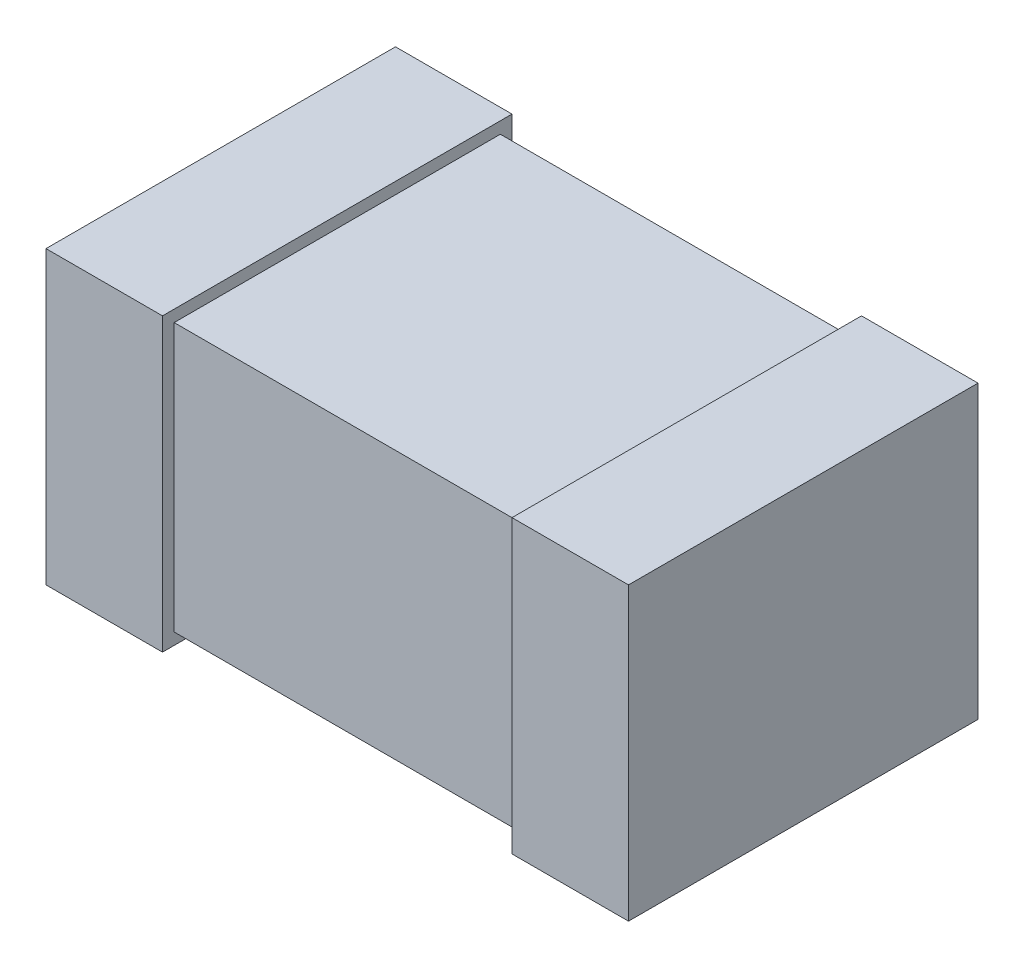
ISO-10303-21;
HEADER;
FILE_DESCRIPTION(('STEP AP214'),'2;1');
FILE_NAME('part.step','',(''),(''),'','','');
FILE_SCHEMA(('AUTOMOTIVE_DESIGN { 1 0 10303 214 1 1 1 1 }'));
ENDSEC;
DATA;
#1=APPLICATION_CONTEXT('core data for automotive mechanical design processes');
#2=APPLICATION_PROTOCOL_DEFINITION('international standard','automotive_design',2000,#1);
#3=PRODUCT_CONTEXT('',#1,'mechanical');
#4=PRODUCT('Part','Part','',(#3));
#5=PRODUCT_RELATED_PRODUCT_CATEGORY('part','',(#4));
#6=PRODUCT_DEFINITION_FORMATION('','',#4);
#7=PRODUCT_DEFINITION_CONTEXT('part definition',#1,'design');
#8=PRODUCT_DEFINITION('design','',#6,#7);
#9=PRODUCT_DEFINITION_SHAPE('','',#8);
#10=(LENGTH_UNIT() NAMED_UNIT(*) SI_UNIT(.MILLI.,.METRE.));
#11=(NAMED_UNIT(*) PLANE_ANGLE_UNIT() SI_UNIT($,.RADIAN.));
#12=(NAMED_UNIT(*) SI_UNIT($,.STERADIAN.) SOLID_ANGLE_UNIT());
#13=UNCERTAINTY_MEASURE_WITH_UNIT(LENGTH_MEASURE(1.E-05),#10,'distance_accuracy_value','');
#14=(GEOMETRIC_REPRESENTATION_CONTEXT(3) GLOBAL_UNCERTAINTY_ASSIGNED_CONTEXT((#13)) GLOBAL_UNIT_ASSIGNED_CONTEXT((#10,
#11,#12)) REPRESENTATION_CONTEXT('',''));
#15=CARTESIAN_POINT('',(0.,0.,0.));
#16=DIRECTION('',(0.,0.,1.));
#17=DIRECTION('',(1.,0.,0.));
#18=AXIS2_PLACEMENT_3D('',#15,#16,#17);
#19=CARTESIAN_POINT('',(0.5,-0.25,0.0762));
#20=DIRECTION('',(1.,0.,0.));
#21=DIRECTION('',(0.,1.,0.));
#22=AXIS2_PLACEMENT_3D('',#19,#20,#21);
#23=PLANE('',#22);
#24=DIRECTION('',(0.,1.,0.));
#25=VECTOR('',#24,1.);
#26=CARTESIAN_POINT('',(0.5,-0.25,0.0762));
#27=LINE('',#26,#25);
#28=CARTESIAN_POINT('',(0.5,-0.25,0.0762));
#29=VERTEX_POINT('',#28);
#30=CARTESIAN_POINT('',(0.5,0.25,0.0762));
#31=VERTEX_POINT('',#30);
#32=EDGE_CURVE('E186',#29,#31,#27,.T.);
#33=ORIENTED_EDGE('',*,*,#32,.T.);
#34=DIRECTION('',(0.,0.,1.));
#35=VECTOR('',#34,1.);
#36=CARTESIAN_POINT('',(0.5,0.25,0.0762));
#37=LINE('',#36,#35);
#38=CARTESIAN_POINT('',(0.5,0.25,0.6762));
#39=VERTEX_POINT('',#38);
#40=EDGE_CURVE('E193',#31,#39,#37,.T.);
#41=ORIENTED_EDGE('',*,*,#40,.T.);
#42=DIRECTION('',(0.,1.,0.));
#43=VECTOR('',#42,1.);
#44=CARTESIAN_POINT('',(0.5,-0.25,0.6762));
#45=LINE('',#44,#43);
#46=CARTESIAN_POINT('',(0.5,-0.25,0.6762));
#47=VERTEX_POINT('',#46);
#48=EDGE_CURVE('E21',#47,#39,#45,.T.);
#49=ORIENTED_EDGE('',*,*,#48,.F.);
#50=DIRECTION('',(0.,0.,1.));
#51=VECTOR('',#50,1.);
#52=CARTESIAN_POINT('',(0.5,-0.25,0.0762));
#53=LINE('',#52,#51);
#54=EDGE_CURVE('E179',#29,#47,#53,.T.);
#55=ORIENTED_EDGE('',*,*,#54,.F.);
#56=EDGE_LOOP('',(#33,#41,#49,#55));
#57=FACE_BOUND('',#56,.T.);
#58=ADVANCED_FACE('F17',(#57),#23,.T.);
#59=CARTESIAN_POINT('',(0.3,-0.23,0.0762));
#60=DIRECTION('',(0.,1.,0.));
#61=DIRECTION('',(1.,0.,0.));
#62=AXIS2_PLACEMENT_3D('',#59,#60,#61);
#63=PLANE('',#62);
#64=DIRECTION('',(-1.,0.,0.));
#65=VECTOR('',#64,1.);
#66=CARTESIAN_POINT('',(0.3,-0.23,0.6562));
#67=LINE('',#66,#65);
#68=CARTESIAN_POINT('',(0.3,-0.23,0.6562));
#69=VERTEX_POINT('',#68);
#70=CARTESIAN_POINT('',(-0.3,-0.23,0.6562));
#71=VERTEX_POINT('',#70);
#72=EDGE_CURVE('E11',#69,#71,#67,.T.);
#73=ORIENTED_EDGE('',*,*,#72,.T.);
#74=DIRECTION('',(0.,0.,-1.));
#75=VECTOR('',#74,1.);
#76=CARTESIAN_POINT('',(-0.3,-0.23,0.6562));
#77=LINE('',#76,#75);
#78=CARTESIAN_POINT('',(-0.3,-0.23,0.0962));
#79=VERTEX_POINT('',#78);
#80=EDGE_CURVE('E156',#71,#79,#77,.T.);
#81=ORIENTED_EDGE('',*,*,#80,.T.);
#82=DIRECTION('',(-1.,0.,0.));
#83=VECTOR('',#82,1.);
#84=CARTESIAN_POINT('',(0.3,-0.23,0.0962));
#85=LINE('',#84,#83);
#86=CARTESIAN_POINT('',(0.3,-0.23,0.0962));
#87=VERTEX_POINT('',#86);
#88=EDGE_CURVE('E141',#87,#79,#85,.T.);
#89=ORIENTED_EDGE('',*,*,#88,.F.);
#90=DIRECTION('',(0.,0.,-1.));
#91=VECTOR('',#90,1.);
#92=CARTESIAN_POINT('',(0.3,-0.23,0.6562));
#93=LINE('',#92,#91);
#94=EDGE_CURVE('E233',#69,#87,#93,.T.);
#95=ORIENTED_EDGE('',*,*,#94,.F.);
#96=EDGE_LOOP('',(#73,#81,#89,#95));
#97=FACE_BOUND('',#96,.T.);
#98=ADVANCED_FACE('F157',(#97),#63,.F.);
#99=CARTESIAN_POINT('',(0.3,0.25,0.6562));
#100=DIRECTION('',(0.,0.,-1.));
#101=DIRECTION('',(0.,-1.,0.));
#102=AXIS2_PLACEMENT_3D('',#99,#100,#101);
#103=PLANE('',#102);
#104=DIRECTION('',(1.,0.,0.));
#105=VECTOR('',#104,1.);
#106=CARTESIAN_POINT('',(-0.3,0.23,0.6562));
#107=LINE('',#106,#105);
#108=CARTESIAN_POINT('',(-0.3,0.23,0.6562));
#109=VERTEX_POINT('',#108);
#110=CARTESIAN_POINT('',(0.3,0.23,0.6562));
#111=VERTEX_POINT('',#110);
#112=EDGE_CURVE('E28',#109,#111,#107,.T.);
#113=ORIENTED_EDGE('',*,*,#112,.F.);
#114=DIRECTION('',(0.,-1.,0.));
#115=VECTOR('',#114,1.);
#116=CARTESIAN_POINT('',(-0.3,0.23,0.6562));
#117=LINE('',#116,#115);
#118=EDGE_CURVE('E172',#109,#71,#117,.T.);
#119=ORIENTED_EDGE('',*,*,#118,.T.);
#120=ORIENTED_EDGE('',*,*,#72,.F.);
#121=DIRECTION('',(0.,-1.,0.));
#122=VECTOR('',#121,1.);
#123=CARTESIAN_POINT('',(0.3,0.23,0.6562));
#124=LINE('',#123,#122);
#125=EDGE_CURVE('E225',#111,#69,#124,.T.);
#126=ORIENTED_EDGE('',*,*,#125,.F.);
#127=EDGE_LOOP('',(#113,#119,#120,#126));
#128=FACE_BOUND('',#127,.T.);
#129=ADVANCED_FACE('F286',(#128),#103,.F.);
#130=CARTESIAN_POINT('',(-0.3,0.23,0.0762));
#131=DIRECTION('',(0.,-1.,0.));
#132=DIRECTION('',(0.,0.,-1.));
#133=AXIS2_PLACEMENT_3D('',#130,#131,#132);
#134=PLANE('',#133);
#135=ORIENTED_EDGE('',*,*,#112,.T.);
#136=DIRECTION('',(0.,0.,-1.));
#137=VECTOR('',#136,1.);
#138=CARTESIAN_POINT('',(0.3,0.23,0.6562));
#139=LINE('',#138,#137);
#140=CARTESIAN_POINT('',(0.3,0.23,0.0962));
#141=VERTEX_POINT('',#140);
#142=EDGE_CURVE('E219',#111,#141,#139,.T.);
#143=ORIENTED_EDGE('',*,*,#142,.T.);
#144=DIRECTION('',(1.,0.,0.));
#145=VECTOR('',#144,1.);
#146=CARTESIAN_POINT('',(-0.3,0.23,0.0962));
#147=LINE('',#146,#145);
#148=CARTESIAN_POINT('',(-0.3,0.23,0.0962));
#149=VERTEX_POINT('',#148);
#150=EDGE_CURVE('E153',#149,#141,#147,.T.);
#151=ORIENTED_EDGE('',*,*,#150,.F.);
#152=DIRECTION('',(0.,0.,-1.));
#153=VECTOR('',#152,1.);
#154=CARTESIAN_POINT('',(-0.3,0.23,0.6562));
#155=LINE('',#154,#153);
#156=EDGE_CURVE('E165',#109,#149,#155,.T.);
#157=ORIENTED_EDGE('',*,*,#156,.F.);
#158=EDGE_LOOP('',(#135,#143,#151,#157));
#159=FACE_BOUND('',#158,.T.);
#160=ADVANCED_FACE('F288',(#159),#134,.F.);
#161=CARTESIAN_POINT('',(-0.3,0.25,0.0962));
#162=DIRECTION('',(0.,0.,1.));
#163=DIRECTION('',(1.,0.,0.));
#164=AXIS2_PLACEMENT_3D('',#161,#162,#163);
#165=PLANE('',#164);
#166=ORIENTED_EDGE('',*,*,#150,.T.);
#167=DIRECTION('',(0.,-1.,0.));
#168=VECTOR('',#167,1.);
#169=CARTESIAN_POINT('',(0.3,0.23,0.0962));
#170=LINE('',#169,#168);
#171=EDGE_CURVE('E149',#141,#87,#170,.T.);
#172=ORIENTED_EDGE('',*,*,#171,.T.);
#173=ORIENTED_EDGE('',*,*,#88,.T.);
#174=DIRECTION('',(0.,-1.,0.));
#175=VECTOR('',#174,1.);
#176=CARTESIAN_POINT('',(-0.3,0.23,0.0962));
#177=LINE('',#176,#175);
#178=EDGE_CURVE('E146',#149,#79,#177,.T.);
#179=ORIENTED_EDGE('',*,*,#178,.F.);
#180=EDGE_LOOP('',(#166,#172,#173,#179));
#181=FACE_BOUND('',#180,.T.);
#182=ADVANCED_FACE('F144',(#181),#165,.F.);
#183=CARTESIAN_POINT('',(0.3,0.23,0.0762));
#184=DIRECTION('',(1.,0.,0.));
#185=DIRECTION('',(0.,1.,0.));
#186=AXIS2_PLACEMENT_3D('',#183,#184,#185);
#187=PLANE('',#186);
#188=ORIENTED_EDGE('',*,*,#171,.F.);
#189=ORIENTED_EDGE('',*,*,#142,.F.);
#190=ORIENTED_EDGE('',*,*,#125,.T.);
#191=ORIENTED_EDGE('',*,*,#94,.T.);
#192=EDGE_LOOP('',(#188,#189,#190,#191));
#193=FACE_BOUND('',#192,.T.);
#194=DIRECTION('',(0.,-1.,0.));
#195=VECTOR('',#194,1.);
#196=CARTESIAN_POINT('',(0.3,0.25,0.6762));
#197=LINE('',#196,#195);
#198=CARTESIAN_POINT('',(0.3,0.25,0.6762));
#199=VERTEX_POINT('',#198);
#200=CARTESIAN_POINT('',(0.3,-0.25,0.6762));
#201=VERTEX_POINT('',#200);
#202=EDGE_CURVE('E197',#199,#201,#197,.T.);
#203=ORIENTED_EDGE('',*,*,#202,.F.);
#204=DIRECTION('',(0.,0.,1.));
#205=VECTOR('',#204,1.);
#206=CARTESIAN_POINT('',(0.3,0.25,0.0762));
#207=LINE('',#206,#205);
#208=CARTESIAN_POINT('',(0.3,0.25,0.0762));
#209=VERTEX_POINT('',#208);
#210=EDGE_CURVE('E250',#209,#199,#207,.T.);
#211=ORIENTED_EDGE('',*,*,#210,.F.);
#212=DIRECTION('',(0.,1.,0.));
#213=VECTOR('',#212,1.);
#214=CARTESIAN_POINT('',(0.3,-0.25,0.0762));
#215=LINE('',#214,#213);
#216=CARTESIAN_POINT('',(0.3,-0.25,0.0762));
#217=VERTEX_POINT('',#216);
#218=EDGE_CURVE('E239',#217,#209,#215,.T.);
#219=ORIENTED_EDGE('',*,*,#218,.F.);
#220=DIRECTION('',(0.,0.,1.));
#221=VECTOR('',#220,1.);
#222=CARTESIAN_POINT('',(0.3,-0.25,0.0762));
#223=LINE('',#222,#221);
#224=EDGE_CURVE('E176',#217,#201,#223,.T.);
#225=ORIENTED_EDGE('',*,*,#224,.T.);
#226=EDGE_LOOP('',(#203,#211,#219,#225));
#227=FACE_BOUND('',#226,.T.);
#228=ADVANCED_FACE('F282',(#193,#227),#187,.F.);
#229=CARTESIAN_POINT('',(0.,0.,0.6762));
#230=DIRECTION('',(0.,0.,1.));
#231=DIRECTION('',(1.,0.,0.));
#232=AXIS2_PLACEMENT_3D('',#229,#230,#231);
#233=PLANE('',#232);
#234=DIRECTION('',(0.,1.,0.));
#235=VECTOR('',#234,1.);
#236=CARTESIAN_POINT('',(-0.3,-0.25,0.6762));
#237=LINE('',#236,#235);
#238=CARTESIAN_POINT('',(-0.3,-0.25,0.6762));
#239=VERTEX_POINT('',#238);
#240=CARTESIAN_POINT('',(-0.3,0.25,0.6762));
#241=VERTEX_POINT('',#240);
#242=EDGE_CURVE('E187',#239,#241,#237,.T.);
#243=ORIENTED_EDGE('',*,*,#242,.T.);
#244=DIRECTION('',(-1.,0.,0.));
#245=VECTOR('',#244,1.);
#246=CARTESIAN_POINT('',(-0.3,0.25,0.6762));
#247=LINE('',#246,#245);
#248=CARTESIAN_POINT('',(-0.5,0.25,0.6762));
#249=VERTEX_POINT('',#248);
#250=EDGE_CURVE('E247',#241,#249,#247,.T.);
#251=ORIENTED_EDGE('',*,*,#250,.T.);
#252=DIRECTION('',(0.,-1.,0.));
#253=VECTOR('',#252,1.);
#254=CARTESIAN_POINT('',(-0.5,0.25,0.6762));
#255=LINE('',#254,#253);
#256=CARTESIAN_POINT('',(-0.5,-0.25,0.6762));
#257=VERTEX_POINT('',#256);
#258=EDGE_CURVE('E206',#249,#257,#255,.T.);
#259=ORIENTED_EDGE('',*,*,#258,.T.);
#260=DIRECTION('',(1.,0.,0.));
#261=VECTOR('',#260,1.);
#262=CARTESIAN_POINT('',(-0.5,-0.25,0.6762));
#263=LINE('',#262,#261);
#264=EDGE_CURVE('E161',#257,#239,#263,.T.);
#265=ORIENTED_EDGE('',*,*,#264,.T.);
#266=EDGE_LOOP('',(#243,#251,#259,#265));
#267=FACE_BOUND('',#266,.T.);
#268=ADVANCED_FACE('F337',(#267),#233,.T.);
#269=CARTESIAN_POINT('',(0.,0.,0.6762));
#270=DIRECTION('',(0.,0.,1.));
#271=DIRECTION('',(1.,0.,0.));
#272=AXIS2_PLACEMENT_3D('',#269,#270,#271);
#273=PLANE('',#272);
#274=ORIENTED_EDGE('',*,*,#202,.T.);
#275=DIRECTION('',(1.,0.,0.));
#276=VECTOR('',#275,1.);
#277=CARTESIAN_POINT('',(0.3,-0.25,0.6762));
#278=LINE('',#277,#276);
#279=EDGE_CURVE('E202',#201,#47,#278,.T.);
#280=ORIENTED_EDGE('',*,*,#279,.T.);
#281=ORIENTED_EDGE('',*,*,#48,.T.);
#282=DIRECTION('',(-1.,0.,0.));
#283=VECTOR('',#282,1.);
#284=CARTESIAN_POINT('',(0.5,0.25,0.6762));
#285=LINE('',#284,#283);
#286=EDGE_CURVE('E198',#39,#199,#285,.T.);
#287=ORIENTED_EDGE('',*,*,#286,.T.);
#288=EDGE_LOOP('',(#274,#280,#281,#287));
#289=FACE_BOUND('',#288,.T.);
#290=ADVANCED_FACE('F318',(#289),#273,.T.);
#291=CARTESIAN_POINT('',(0.5,0.25,0.0762));
#292=DIRECTION('',(0.,1.,0.));
#293=DIRECTION('',(1.,0.,0.));
#294=AXIS2_PLACEMENT_3D('',#291,#292,#293);
#295=PLANE('',#294);
#296=ORIENTED_EDGE('',*,*,#210,.T.);
#297=ORIENTED_EDGE('',*,*,#286,.F.);
#298=ORIENTED_EDGE('',*,*,#40,.F.);
#299=DIRECTION('',(-1.,0.,0.));
#300=VECTOR('',#299,1.);
#301=CARTESIAN_POINT('',(0.5,0.25,0.0762));
#302=LINE('',#301,#300);
#303=EDGE_CURVE('E257',#31,#209,#302,.T.);
#304=ORIENTED_EDGE('',*,*,#303,.T.);
#305=EDGE_LOOP('',(#296,#297,#298,#304));
#306=FACE_BOUND('',#305,.T.);
#307=ADVANCED_FACE('F314',(#306),#295,.T.);
#308=CARTESIAN_POINT('',(0.5,0.25,0.0762));
#309=DIRECTION('',(0.,1.,0.));
#310=DIRECTION('',(1.,0.,0.));
#311=AXIS2_PLACEMENT_3D('',#308,#309,#310);
#312=PLANE('',#311);
#313=DIRECTION('',(0.,0.,1.));
#314=VECTOR('',#313,1.);
#315=CARTESIAN_POINT('',(-0.3,0.25,0.0762));
#316=LINE('',#315,#314);
#317=CARTESIAN_POINT('',(-0.3,0.25,0.0762));
#318=VERTEX_POINT('',#317);
#319=EDGE_CURVE('E185',#318,#241,#316,.T.);
#320=ORIENTED_EDGE('',*,*,#319,.F.);
#321=DIRECTION('',(-1.,0.,0.));
#322=VECTOR('',#321,1.);
#323=CARTESIAN_POINT('',(-0.3,0.25,0.0762));
#324=LINE('',#323,#322);
#325=CARTESIAN_POINT('',(-0.5,0.25,0.0762));
#326=VERTEX_POINT('',#325);
#327=EDGE_CURVE('E236',#318,#326,#324,.T.);
#328=ORIENTED_EDGE('',*,*,#327,.T.);
#329=DIRECTION('',(0.,0.,1.));
#330=VECTOR('',#329,1.);
#331=CARTESIAN_POINT('',(-0.5,0.25,0.0762));
#332=LINE('',#331,#330);
#333=EDGE_CURVE('E106',#326,#249,#332,.T.);
#334=ORIENTED_EDGE('',*,*,#333,.T.);
#335=ORIENTED_EDGE('',*,*,#250,.F.);
#336=EDGE_LOOP('',(#320,#328,#334,#335));
#337=FACE_BOUND('',#336,.T.);
#338=ADVANCED_FACE('F307',(#337),#312,.T.);
#339=CARTESIAN_POINT('',(-0.5,0.25,0.0762));
#340=DIRECTION('',(-1.,0.,0.));
#341=DIRECTION('',(0.,0.,1.));
#342=AXIS2_PLACEMENT_3D('',#339,#340,#341);
#343=PLANE('',#342);
#344=DIRECTION('',(0.,-1.,0.));
#345=VECTOR('',#344,1.);
#346=CARTESIAN_POINT('',(-0.5,0.25,0.0762));
#347=LINE('',#346,#345);
#348=CARTESIAN_POINT('',(-0.5,-0.25,0.0762));
#349=VERTEX_POINT('',#348);
#350=EDGE_CURVE('E240',#326,#349,#347,.T.);
#351=ORIENTED_EDGE('',*,*,#350,.T.);
#352=DIRECTION('',(0.,0.,1.));
#353=VECTOR('',#352,1.);
#354=CARTESIAN_POINT('',(-0.5,-0.25,0.0762));
#355=LINE('',#354,#353);
#356=EDGE_CURVE('E118',#349,#257,#355,.T.);
#357=ORIENTED_EDGE('',*,*,#356,.T.);
#358=ORIENTED_EDGE('',*,*,#258,.F.);
#359=ORIENTED_EDGE('',*,*,#333,.F.);
#360=EDGE_LOOP('',(#351,#357,#358,#359));
#361=FACE_BOUND('',#360,.T.);
#362=ADVANCED_FACE('F19',(#361),#343,.T.);
#363=CARTESIAN_POINT('',(-0.5,-0.25,0.0762));
#364=DIRECTION('',(0.,-1.,0.));
#365=DIRECTION('',(0.,0.,-1.));
#366=AXIS2_PLACEMENT_3D('',#363,#364,#365);
#367=PLANE('',#366);
#368=ORIENTED_EDGE('',*,*,#224,.F.);
#369=DIRECTION('',(1.,0.,0.));
#370=VECTOR('',#369,1.);
#371=CARTESIAN_POINT('',(0.3,-0.25,0.0762));
#372=LINE('',#371,#370);
#373=EDGE_CURVE('E181',#217,#29,#372,.T.);
#374=ORIENTED_EDGE('',*,*,#373,.T.);
#375=ORIENTED_EDGE('',*,*,#54,.T.);
#376=ORIENTED_EDGE('',*,*,#279,.F.);
#377=EDGE_LOOP('',(#368,#374,#375,#376));
#378=FACE_BOUND('',#377,.T.);
#379=ADVANCED_FACE('F306',(#378),#367,.T.);
#380=CARTESIAN_POINT('',(-0.5,-0.25,0.0762));
#381=DIRECTION('',(0.,-1.,0.));
#382=DIRECTION('',(0.,0.,-1.));
#383=AXIS2_PLACEMENT_3D('',#380,#381,#382);
#384=PLANE('',#383);
#385=DIRECTION('',(0.,0.,1.));
#386=VECTOR('',#385,1.);
#387=CARTESIAN_POINT('',(-0.3,-0.25,0.0762));
#388=LINE('',#387,#386);
#389=CARTESIAN_POINT('',(-0.3,-0.25,0.0762));
#390=VERTEX_POINT('',#389);
#391=EDGE_CURVE('E129',#390,#239,#388,.T.);
#392=ORIENTED_EDGE('',*,*,#391,.T.);
#393=ORIENTED_EDGE('',*,*,#264,.F.);
#394=ORIENTED_EDGE('',*,*,#356,.F.);
#395=DIRECTION('',(1.,0.,0.));
#396=VECTOR('',#395,1.);
#397=CARTESIAN_POINT('',(-0.5,-0.25,0.0762));
#398=LINE('',#397,#396);
#399=EDGE_CURVE('E246',#349,#390,#398,.T.);
#400=ORIENTED_EDGE('',*,*,#399,.T.);
#401=EDGE_LOOP('',(#392,#393,#394,#400));
#402=FACE_BOUND('',#401,.T.);
#403=ADVANCED_FACE('F327',(#402),#384,.T.);
#404=CARTESIAN_POINT('',(-0.3,0.25,0.0762));
#405=DIRECTION('',(-1.,0.,0.));
#406=DIRECTION('',(0.,0.,1.));
#407=AXIS2_PLACEMENT_3D('',#404,#405,#406);
#408=PLANE('',#407);
#409=ORIENTED_EDGE('',*,*,#118,.F.);
#410=ORIENTED_EDGE('',*,*,#156,.T.);
#411=ORIENTED_EDGE('',*,*,#178,.T.);
#412=ORIENTED_EDGE('',*,*,#80,.F.);
#413=EDGE_LOOP('',(#409,#410,#411,#412));
#414=FACE_BOUND('',#413,.T.);
#415=DIRECTION('',(0.,-1.,0.));
#416=VECTOR('',#415,1.);
#417=CARTESIAN_POINT('',(-0.3,0.25,0.0762));
#418=LINE('',#417,#416);
#419=EDGE_CURVE('E252',#318,#390,#418,.T.);
#420=ORIENTED_EDGE('',*,*,#419,.F.);
#421=ORIENTED_EDGE('',*,*,#319,.T.);
#422=ORIENTED_EDGE('',*,*,#242,.F.);
#423=ORIENTED_EDGE('',*,*,#391,.F.);
#424=EDGE_LOOP('',(#420,#421,#422,#423));
#425=FACE_BOUND('',#424,.T.);
#426=ADVANCED_FACE('F163',(#414,#425),#408,.F.);
#427=CARTESIAN_POINT('',(0.,0.,0.0762));
#428=DIRECTION('',(0.,0.,1.));
#429=DIRECTION('',(1.,0.,0.));
#430=AXIS2_PLACEMENT_3D('',#427,#428,#429);
#431=PLANE('',#430);
#432=ORIENTED_EDGE('',*,*,#218,.T.);
#433=ORIENTED_EDGE('',*,*,#303,.F.);
#434=ORIENTED_EDGE('',*,*,#32,.F.);
#435=ORIENTED_EDGE('',*,*,#373,.F.);
#436=EDGE_LOOP('',(#432,#433,#434,#435));
#437=FACE_BOUND('',#436,.T.);
#438=ADVANCED_FACE('F369',(#437),#431,.F.);
#439=CARTESIAN_POINT('',(0.,0.,0.0762));
#440=DIRECTION('',(0.,0.,1.));
#441=DIRECTION('',(1.,0.,0.));
#442=AXIS2_PLACEMENT_3D('',#439,#440,#441);
#443=PLANE('',#442);
#444=ORIENTED_EDGE('',*,*,#419,.T.);
#445=ORIENTED_EDGE('',*,*,#399,.F.);
#446=ORIENTED_EDGE('',*,*,#350,.F.);
#447=ORIENTED_EDGE('',*,*,#327,.F.);
#448=EDGE_LOOP('',(#444,#445,#446,#447));
#449=FACE_BOUND('',#448,.T.);
#450=ADVANCED_FACE('F381',(#449),#443,.F.);
#451=CLOSED_SHELL('',(#58,#98,#129,#160,#182,#228,#268,#290,#307,#338,#362,#379,#403,#426,#438,#450));
#452=MANIFOLD_SOLID_BREP('B1',#451);
#453=ADVANCED_BREP_SHAPE_REPRESENTATION('',(#18,#452),#14);
#454=SHAPE_DEFINITION_REPRESENTATION(#9,#453);
ENDSEC;
END-ISO-10303-21;
